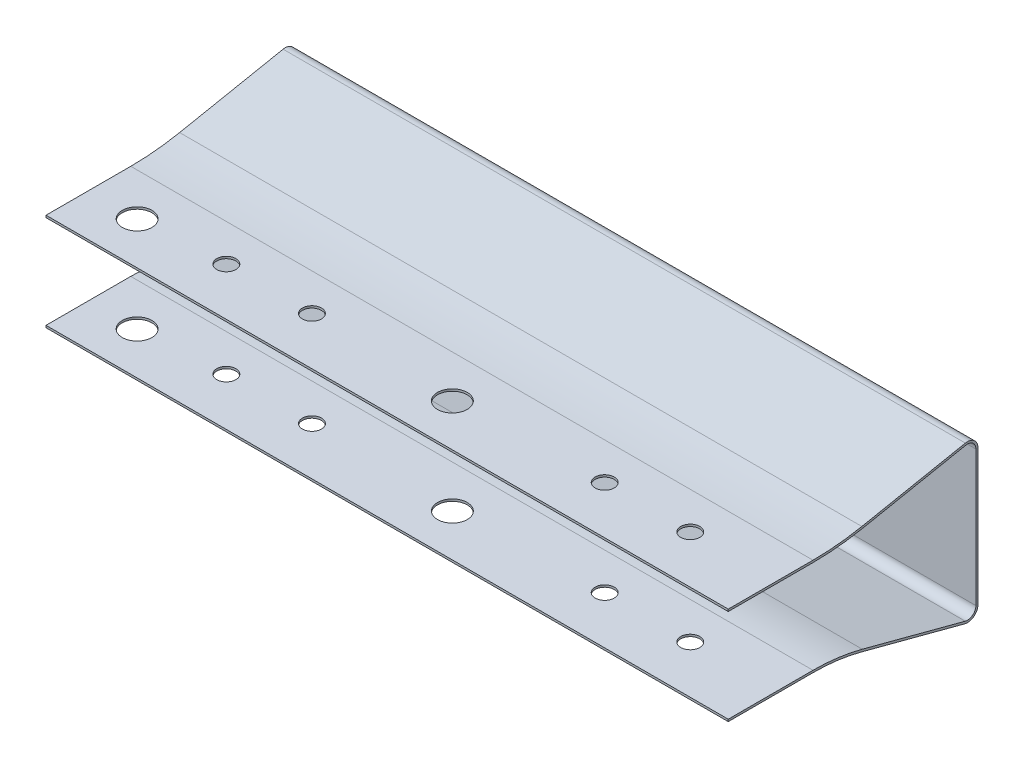
ISO-10303-21;
HEADER;
FILE_DESCRIPTION(('STEP AP214'),'2;1');
FILE_NAME('part.step','',(''),(''),'','','');
FILE_SCHEMA(('AUTOMOTIVE_DESIGN { 1 0 10303 214 1 1 1 1 }'));
ENDSEC;
DATA;
#1=APPLICATION_CONTEXT('core data for automotive mechanical design processes');
#2=APPLICATION_PROTOCOL_DEFINITION('international standard','automotive_design',2000,#1);
#3=PRODUCT_CONTEXT('',#1,'mechanical');
#4=PRODUCT('Part','Part','',(#3));
#5=PRODUCT_RELATED_PRODUCT_CATEGORY('part','',(#4));
#6=PRODUCT_DEFINITION_FORMATION('','',#4);
#7=PRODUCT_DEFINITION_CONTEXT('part definition',#1,'design');
#8=PRODUCT_DEFINITION('design','',#6,#7);
#9=PRODUCT_DEFINITION_SHAPE('','',#8);
#10=(LENGTH_UNIT() NAMED_UNIT(*) SI_UNIT(.MILLI.,.METRE.));
#11=(NAMED_UNIT(*) PLANE_ANGLE_UNIT() SI_UNIT($,.RADIAN.));
#12=(NAMED_UNIT(*) SI_UNIT($,.STERADIAN.) SOLID_ANGLE_UNIT());
#13=UNCERTAINTY_MEASURE_WITH_UNIT(LENGTH_MEASURE(1.E-05),#10,'distance_accuracy_value','');
#14=(GEOMETRIC_REPRESENTATION_CONTEXT(3) GLOBAL_UNCERTAINTY_ASSIGNED_CONTEXT((#13)) GLOBAL_UNIT_ASSIGNED_CONTEXT((#10,
#11,#12)) REPRESENTATION_CONTEXT('',''));
#15=CARTESIAN_POINT('',(0.,0.,0.));
#16=DIRECTION('',(0.,0.,1.));
#17=DIRECTION('',(1.,0.,0.));
#18=AXIS2_PLACEMENT_3D('',#15,#16,#17);
#19=CARTESIAN_POINT('',(40.25,8.,-23.22));
#20=DIRECTION('',(-1.,0.,0.));
#21=DIRECTION('',(0.,0.,-1.));
#22=AXIS2_PLACEMENT_3D('',#19,#20,#21);
#23=CYLINDRICAL_SURFACE('',#22,1.);
#24=CARTESIAN_POINT('',(-40.25,8.,-23.22));
#25=DIRECTION('',(1.,0.,0.));
#26=DIRECTION('',(0.,0.,1.));
#27=AXIS2_PLACEMENT_3D('',#24,#25,#26);
#28=CIRCLE('',#27,1.);
#29=CARTESIAN_POINT('',(-40.25,8.,-24.22));
#30=VERTEX_POINT('',#29);
#31=CARTESIAN_POINT('',(-40.25,8.98104394957776,-23.0262146316233));
#32=VERTEX_POINT('',#31);
#33=EDGE_CURVE('E206',#30,#32,#28,.T.);
#34=ORIENTED_EDGE('',*,*,#33,.F.);
#35=DIRECTION('',(-1.,0.,0.));
#36=VECTOR('',#35,1.);
#37=CARTESIAN_POINT('',(40.25,8.,-24.22));
#38=LINE('',#37,#36);
#39=CARTESIAN_POINT('',(40.25,8.,-24.22));
#40=VERTEX_POINT('',#39);
#41=EDGE_CURVE('E205',#40,#30,#38,.T.);
#42=ORIENTED_EDGE('',*,*,#41,.F.);
#43=CARTESIAN_POINT('',(40.25,8.,-23.22));
#44=DIRECTION('',(1.,0.,0.));
#45=DIRECTION('',(0.,0.,1.));
#46=AXIS2_PLACEMENT_3D('',#43,#44,#45);
#47=CIRCLE('',#46,1.);
#48=CARTESIAN_POINT('',(40.25,8.98104394957776,-23.0262146316233));
#49=VERTEX_POINT('',#48);
#50=EDGE_CURVE('E261',#40,#49,#47,.T.);
#51=ORIENTED_EDGE('',*,*,#50,.T.);
#52=DIRECTION('',(-1.,0.,0.));
#53=VECTOR('',#52,1.);
#54=CARTESIAN_POINT('',(40.25,8.98104394957776,-23.0262146316233));
#55=LINE('',#54,#53);
#56=EDGE_CURVE('E11',#49,#32,#55,.T.);
#57=ORIENTED_EDGE('',*,*,#56,.T.);
#58=EDGE_LOOP('',(#34,#42,#51,#57));
#59=FACE_BOUND('',#58,.T.);
#60=ADVANCED_FACE('F36',(#59),#23,.F.);
#61=CARTESIAN_POINT('',(40.25,6.56868151266737,-10.8135610513));
#62=DIRECTION('',(0.,0.981043949577754,0.193785368376667));
#63=DIRECTION('',(0.,0.193785368376667,-0.981043949577755));
#64=AXIS2_PLACEMENT_3D('',#61,#62,#63);
#65=PLANE('',#64);
#66=DIRECTION('',(0.,-0.193785368376667,0.981043949577754));
#67=VECTOR('',#66,1.);
#68=CARTESIAN_POINT('',(-40.25,6.56868151266737,-10.8135610513));
#69=LINE('',#68,#67);
#70=CARTESIAN_POINT('',(-40.25,6.56868151266737,-10.8135610513));
#71=VERTEX_POINT('',#70);
#72=EDGE_CURVE('E208',#32,#71,#69,.T.);
#73=ORIENTED_EDGE('',*,*,#72,.F.);
#74=ORIENTED_EDGE('',*,*,#56,.F.);
#75=DIRECTION('',(0.,-0.193785368376667,0.981043949577754));
#76=VECTOR('',#75,1.);
#77=CARTESIAN_POINT('',(40.25,6.56868151266737,-10.8135610513));
#78=LINE('',#77,#76);
#79=CARTESIAN_POINT('',(40.25,6.56868151266737,-10.8135610513));
#80=VERTEX_POINT('',#79);
#81=EDGE_CURVE('E128',#49,#80,#78,.T.);
#82=ORIENTED_EDGE('',*,*,#81,.T.);
#83=DIRECTION('',(-1.,0.,0.));
#84=VECTOR('',#83,1.);
#85=CARTESIAN_POINT('',(40.25,6.56868151266737,-10.8135610513));
#86=LINE('',#85,#84);
#87=EDGE_CURVE('E45',#80,#71,#86,.T.);
#88=ORIENTED_EDGE('',*,*,#87,.T.);
#89=EDGE_LOOP('',(#73,#74,#82,#88));
#90=FACE_BOUND('',#89,.T.);
#91=ADVANCED_FACE('F468',(#90),#65,.F.);
#92=CARTESIAN_POINT('',(40.25,36.,-5.));
#93=DIRECTION('',(-1.,0.,0.));
#94=DIRECTION('',(0.,0.,-1.));
#95=AXIS2_PLACEMENT_3D('',#92,#93,#94);
#96=CYLINDRICAL_SURFACE('',#95,30.);
#97=CARTESIAN_POINT('',(-40.25,36.,-5.));
#98=DIRECTION('',(-1.,0.,0.));
#99=DIRECTION('',(0.,0.,-1.));
#100=AXIS2_PLACEMENT_3D('',#97,#98,#99);
#101=CIRCLE('',#100,30.);
#102=CARTESIAN_POINT('',(-40.25,6.,-5.));
#103=VERTEX_POINT('',#102);
#104=EDGE_CURVE('E212',#71,#103,#101,.T.);
#105=ORIENTED_EDGE('',*,*,#104,.F.);
#106=ORIENTED_EDGE('',*,*,#87,.F.);
#107=CARTESIAN_POINT('',(40.25,36.,-5.));
#108=DIRECTION('',(-1.,0.,0.));
#109=DIRECTION('',(0.,0.,-1.));
#110=AXIS2_PLACEMENT_3D('',#107,#108,#109);
#111=CIRCLE('',#110,30.);
#112=CARTESIAN_POINT('',(40.25,6.,-5.));
#113=VERTEX_POINT('',#112);
#114=EDGE_CURVE('E382',#80,#113,#111,.T.);
#115=ORIENTED_EDGE('',*,*,#114,.T.);
#116=DIRECTION('',(-1.,0.,0.));
#117=VECTOR('',#116,1.);
#118=CARTESIAN_POINT('',(40.25,6.,-5.));
#119=LINE('',#118,#117);
#120=EDGE_CURVE('E304',#113,#103,#119,.T.);
#121=ORIENTED_EDGE('',*,*,#120,.T.);
#122=EDGE_LOOP('',(#105,#106,#115,#121));
#123=FACE_BOUND('',#122,.T.);
#124=ADVANCED_FACE('F466',(#123),#96,.T.);
#125=CARTESIAN_POINT('',(40.25,6.,-5.));
#126=DIRECTION('',(0.,1.,0.));
#127=DIRECTION('',(0.,0.,-1.));
#128=AXIS2_PLACEMENT_3D('',#125,#126,#127);
#129=PLANE('',#128);
#130=CARTESIAN_POINT('',(30.12,6.,-0.649999999999999));
#131=DIRECTION('',(0.,-1.,0.));
#132=DIRECTION('',(0.,0.,-1.));
#133=AXIS2_PLACEMENT_3D('',#130,#131,#132);
#134=CIRCLE('',#133,1.125);
#135=CARTESIAN_POINT('',(30.12,6.,-1.775));
#136=VERTEX_POINT('',#135);
#137=EDGE_CURVE('E331',#136,#136,#134,.T.);
#138=ORIENTED_EDGE('',*,*,#137,.F.);
#139=EDGE_LOOP('',(#138));
#140=FACE_BOUND('',#139,.T.);
#141=CARTESIAN_POINT('',(20.02,6.,-0.649999999999998));
#142=DIRECTION('',(0.,-1.,0.));
#143=DIRECTION('',(0.,0.,-1.));
#144=AXIS2_PLACEMENT_3D('',#141,#142,#143);
#145=CIRCLE('',#144,1.125);
#146=CARTESIAN_POINT('',(20.02,6.,-1.775));
#147=VERTEX_POINT('',#146);
#148=EDGE_CURVE('E327',#147,#147,#145,.T.);
#149=ORIENTED_EDGE('',*,*,#148,.F.);
#150=EDGE_LOOP('',(#149));
#151=FACE_BOUND('',#150,.T.);
#152=CARTESIAN_POINT('',(2.69999999999999,6.,0.));
#153=DIRECTION('',(0.,-1.,0.));
#154=DIRECTION('',(0.,0.,-1.));
#155=AXIS2_PLACEMENT_3D('',#152,#153,#154);
#156=CIRCLE('',#155,1.75);
#157=CARTESIAN_POINT('',(2.69999999999999,6.,-1.75));
#158=VERTEX_POINT('',#157);
#159=EDGE_CURVE('E323',#158,#158,#156,.T.);
#160=ORIENTED_EDGE('',*,*,#159,.F.);
#161=EDGE_LOOP('',(#160));
#162=FACE_BOUND('',#161,.T.);
#163=CARTESIAN_POINT('',(-14.52,6.,-0.649999999999999));
#164=DIRECTION('',(0.,-1.,0.));
#165=DIRECTION('',(0.,0.,-1.));
#166=AXIS2_PLACEMENT_3D('',#163,#164,#165);
#167=CIRCLE('',#166,1.125);
#168=CARTESIAN_POINT('',(-14.52,6.,-1.775));
#169=VERTEX_POINT('',#168);
#170=EDGE_CURVE('E318',#169,#169,#167,.T.);
#171=ORIENTED_EDGE('',*,*,#170,.F.);
#172=EDGE_LOOP('',(#171));
#173=FACE_BOUND('',#172,.T.);
#174=CARTESIAN_POINT('',(-24.62,6.,-0.649999999999998));
#175=DIRECTION('',(0.,-1.,0.));
#176=DIRECTION('',(0.,0.,-1.));
#177=AXIS2_PLACEMENT_3D('',#174,#175,#176);
#178=CIRCLE('',#177,1.125);
#179=CARTESIAN_POINT('',(-24.62,6.,-1.775));
#180=VERTEX_POINT('',#179);
#181=EDGE_CURVE('E313',#180,#180,#178,.T.);
#182=ORIENTED_EDGE('',*,*,#181,.F.);
#183=EDGE_LOOP('',(#182));
#184=FACE_BOUND('',#183,.T.);
#185=CARTESIAN_POINT('',(-34.5,6.,0.));
#186=DIRECTION('',(0.,-1.,0.));
#187=DIRECTION('',(0.,0.,-1.));
#188=AXIS2_PLACEMENT_3D('',#185,#186,#187);
#189=CIRCLE('',#188,1.75);
#190=CARTESIAN_POINT('',(-34.5,6.,-1.75));
#191=VERTEX_POINT('',#190);
#192=EDGE_CURVE('E209',#191,#191,#189,.T.);
#193=ORIENTED_EDGE('',*,*,#192,.F.);
#194=EDGE_LOOP('',(#193));
#195=FACE_BOUND('',#194,.T.);
#196=DIRECTION('',(0.,0.,1.));
#197=VECTOR('',#196,1.);
#198=CARTESIAN_POINT('',(-40.25,6.,-5.));
#199=LINE('',#198,#197);
#200=CARTESIAN_POINT('',(-40.25,6.,5.));
#201=VERTEX_POINT('',#200);
#202=EDGE_CURVE('E215',#103,#201,#199,.T.);
#203=ORIENTED_EDGE('',*,*,#202,.F.);
#204=ORIENTED_EDGE('',*,*,#120,.F.);
#205=DIRECTION('',(0.,0.,1.));
#206=VECTOR('',#205,1.);
#207=CARTESIAN_POINT('',(40.25,6.,-5.));
#208=LINE('',#207,#206);
#209=CARTESIAN_POINT('',(40.25,6.,5.));
#210=VERTEX_POINT('',#209);
#211=EDGE_CURVE('E385',#113,#210,#208,.T.);
#212=ORIENTED_EDGE('',*,*,#211,.T.);
#213=DIRECTION('',(-1.,0.,0.));
#214=VECTOR('',#213,1.);
#215=CARTESIAN_POINT('',(40.25,6.,5.));
#216=LINE('',#215,#214);
#217=EDGE_CURVE('E301',#210,#201,#216,.T.);
#218=ORIENTED_EDGE('',*,*,#217,.T.);
#219=EDGE_LOOP('',(#203,#204,#212,#218));
#220=FACE_BOUND('',#219,.T.);
#221=ADVANCED_FACE('F464',(#140,#151,#162,#173,#184,#195,#220),#129,.F.);
#222=CARTESIAN_POINT('',(40.25,6.25,5.));
#223=DIRECTION('',(0.,0.,-1.));
#224=DIRECTION('',(1.,0.,0.));
#225=AXIS2_PLACEMENT_3D('',#222,#223,#224);
#226=PLANE('',#225);
#227=DIRECTION('',(0.,1.,0.));
#228=VECTOR('',#227,1.);
#229=CARTESIAN_POINT('',(-40.25,6.25,5.));
#230=LINE('',#229,#228);
#231=CARTESIAN_POINT('',(-40.25,6.25,5.));
#232=VERTEX_POINT('',#231);
#233=EDGE_CURVE('E218',#201,#232,#230,.T.);
#234=ORIENTED_EDGE('',*,*,#233,.F.);
#235=ORIENTED_EDGE('',*,*,#217,.F.);
#236=DIRECTION('',(0.,1.,0.));
#237=VECTOR('',#236,1.);
#238=CARTESIAN_POINT('',(40.25,6.25,5.));
#239=LINE('',#238,#237);
#240=CARTESIAN_POINT('',(40.25,6.25,5.));
#241=VERTEX_POINT('',#240);
#242=EDGE_CURVE('E388',#210,#241,#239,.T.);
#243=ORIENTED_EDGE('',*,*,#242,.T.);
#244=DIRECTION('',(-1.,0.,0.));
#245=VECTOR('',#244,1.);
#246=CARTESIAN_POINT('',(40.25,6.25,5.));
#247=LINE('',#246,#245);
#248=EDGE_CURVE('E298',#241,#232,#247,.T.);
#249=ORIENTED_EDGE('',*,*,#248,.T.);
#250=EDGE_LOOP('',(#234,#235,#243,#249));
#251=FACE_BOUND('',#250,.T.);
#252=ADVANCED_FACE('F460',(#251),#226,.F.);
#253=CARTESIAN_POINT('',(40.25,6.25,-5.));
#254=DIRECTION('',(0.,-1.,0.));
#255=DIRECTION('',(0.,0.,1.));
#256=AXIS2_PLACEMENT_3D('',#253,#254,#255);
#257=PLANE('',#256);
#258=CARTESIAN_POINT('',(30.12,6.25,-0.649999999999999));
#259=DIRECTION('',(0.,1.,0.));
#260=DIRECTION('',(0.,0.,1.));
#261=AXIS2_PLACEMENT_3D('',#258,#259,#260);
#262=CIRCLE('',#261,1.125);
#263=CARTESIAN_POINT('',(30.12,6.25,0.475000000000003));
#264=VERTEX_POINT('',#263);
#265=EDGE_CURVE('E338',#264,#264,#262,.T.);
#266=ORIENTED_EDGE('',*,*,#265,.F.);
#267=EDGE_LOOP('',(#266));
#268=FACE_BOUND('',#267,.T.);
#269=CARTESIAN_POINT('',(20.02,6.25,-0.649999999999998));
#270=DIRECTION('',(0.,1.,0.));
#271=DIRECTION('',(0.,0.,1.));
#272=AXIS2_PLACEMENT_3D('',#269,#270,#271);
#273=CIRCLE('',#272,1.125);
#274=CARTESIAN_POINT('',(20.02,6.25,0.475000000000003));
#275=VERTEX_POINT('',#274);
#276=EDGE_CURVE('E335',#275,#275,#273,.T.);
#277=ORIENTED_EDGE('',*,*,#276,.F.);
#278=EDGE_LOOP('',(#277));
#279=FACE_BOUND('',#278,.T.);
#280=CARTESIAN_POINT('',(2.69999999999999,6.25,0.));
#281=DIRECTION('',(0.,1.,0.));
#282=DIRECTION('',(0.,0.,1.));
#283=AXIS2_PLACEMENT_3D('',#280,#281,#282);
#284=CIRCLE('',#283,1.75);
#285=CARTESIAN_POINT('',(2.69999999999999,6.25,1.75));
#286=VERTEX_POINT('',#285);
#287=EDGE_CURVE('E353',#286,#286,#284,.T.);
#288=ORIENTED_EDGE('',*,*,#287,.F.);
#289=EDGE_LOOP('',(#288));
#290=FACE_BOUND('',#289,.T.);
#291=CARTESIAN_POINT('',(-14.52,6.25,-0.649999999999999));
#292=DIRECTION('',(0.,1.,0.));
#293=DIRECTION('',(0.,0.,1.));
#294=AXIS2_PLACEMENT_3D('',#291,#292,#293);
#295=CIRCLE('',#294,1.125);
#296=CARTESIAN_POINT('',(-14.52,6.25,0.475000000000003));
#297=VERTEX_POINT('',#296);
#298=EDGE_CURVE('E360',#297,#297,#295,.T.);
#299=ORIENTED_EDGE('',*,*,#298,.F.);
#300=EDGE_LOOP('',(#299));
#301=FACE_BOUND('',#300,.T.);
#302=CARTESIAN_POINT('',(-24.62,6.25,-0.649999999999998));
#303=DIRECTION('',(0.,1.,0.));
#304=DIRECTION('',(0.,0.,1.));
#305=AXIS2_PLACEMENT_3D('',#302,#303,#304);
#306=CIRCLE('',#305,1.125);
#307=CARTESIAN_POINT('',(-24.62,6.25,0.475000000000003));
#308=VERTEX_POINT('',#307);
#309=EDGE_CURVE('E367',#308,#308,#306,.T.);
#310=ORIENTED_EDGE('',*,*,#309,.F.);
#311=EDGE_LOOP('',(#310));
#312=FACE_BOUND('',#311,.T.);
#313=CARTESIAN_POINT('',(-34.5,6.25,0.));
#314=DIRECTION('',(0.,1.,0.));
#315=DIRECTION('',(0.,0.,1.));
#316=AXIS2_PLACEMENT_3D('',#313,#314,#315);
#317=CIRCLE('',#316,1.75);
#318=CARTESIAN_POINT('',(-34.5,6.25,1.75));
#319=VERTEX_POINT('',#318);
#320=EDGE_CURVE('E374',#319,#319,#317,.T.);
#321=ORIENTED_EDGE('',*,*,#320,.F.);
#322=EDGE_LOOP('',(#321));
#323=FACE_BOUND('',#322,.T.);
#324=DIRECTION('',(0.,0.,-1.));
#325=VECTOR('',#324,1.);
#326=CARTESIAN_POINT('',(-40.25,6.25,-5.));
#327=LINE('',#326,#325);
#328=CARTESIAN_POINT('',(-40.25,6.25,-4.99999999999999));
#329=VERTEX_POINT('',#328);
#330=EDGE_CURVE('E221',#232,#329,#327,.T.);
#331=ORIENTED_EDGE('',*,*,#330,.F.);
#332=ORIENTED_EDGE('',*,*,#248,.F.);
#333=DIRECTION('',(0.,0.,-1.));
#334=VECTOR('',#333,1.);
#335=CARTESIAN_POINT('',(40.25,6.25,-5.));
#336=LINE('',#335,#334);
#337=CARTESIAN_POINT('',(40.25,6.25,-4.99999999999999));
#338=VERTEX_POINT('',#337);
#339=EDGE_CURVE('E391',#241,#338,#336,.T.);
#340=ORIENTED_EDGE('',*,*,#339,.T.);
#341=DIRECTION('',(-1.,0.,0.));
#342=VECTOR('',#341,1.);
#343=CARTESIAN_POINT('',(40.25,6.25,-4.99999999999999));
#344=LINE('',#343,#342);
#345=EDGE_CURVE('E295',#338,#329,#344,.T.);
#346=ORIENTED_EDGE('',*,*,#345,.T.);
#347=EDGE_LOOP('',(#331,#332,#340,#346));
#348=FACE_BOUND('',#347,.T.);
#349=ADVANCED_FACE('F457',(#268,#279,#290,#301,#312,#323,#348),#257,.F.);
#350=CARTESIAN_POINT('',(40.25,36.,-5.));
#351=DIRECTION('',(-1.,0.,0.));
#352=DIRECTION('',(0.,0.,-1.));
#353=AXIS2_PLACEMENT_3D('',#350,#351,#352);
#354=CYLINDRICAL_SURFACE('',#353,29.75);
#355=CARTESIAN_POINT('',(-40.25,36.,-5.));
#356=DIRECTION('',(1.,0.,0.));
#357=DIRECTION('',(0.,0.,-1.));
#358=AXIS2_PLACEMENT_3D('',#355,#356,#357);
#359=CIRCLE('',#358,29.75);
#360=CARTESIAN_POINT('',(-40.25,6.81394250006181,-10.7651147092058));
#361=VERTEX_POINT('',#360);
#362=EDGE_CURVE('E224',#329,#361,#359,.T.);
#363=ORIENTED_EDGE('',*,*,#362,.F.);
#364=ORIENTED_EDGE('',*,*,#345,.F.);
#365=CARTESIAN_POINT('',(40.25,36.,-5.));
#366=DIRECTION('',(1.,0.,0.));
#367=DIRECTION('',(0.,0.,-1.));
#368=AXIS2_PLACEMENT_3D('',#365,#366,#367);
#369=CIRCLE('',#368,29.75);
#370=CARTESIAN_POINT('',(40.25,6.81394250006181,-10.7651147092058));
#371=VERTEX_POINT('',#370);
#372=EDGE_CURVE('E394',#338,#371,#369,.T.);
#373=ORIENTED_EDGE('',*,*,#372,.T.);
#374=DIRECTION('',(-1.,0.,0.));
#375=VECTOR('',#374,1.);
#376=CARTESIAN_POINT('',(40.25,6.81394250006181,-10.7651147092058));
#377=LINE('',#376,#375);
#378=EDGE_CURVE('E292',#371,#361,#377,.T.);
#379=ORIENTED_EDGE('',*,*,#378,.T.);
#380=EDGE_LOOP('',(#363,#364,#373,#379));
#381=FACE_BOUND('',#380,.T.);
#382=ADVANCED_FACE('F455',(#381),#354,.F.);
#383=CARTESIAN_POINT('',(40.25,6.81394250006181,-10.7651147092058));
#384=DIRECTION('',(0.,-0.981043949577754,-0.193785368376667));
#385=DIRECTION('',(0.,-0.193785368376668,0.981043949577754));
#386=AXIS2_PLACEMENT_3D('',#383,#384,#385);
#387=PLANE('',#386);
#388=DIRECTION('',(0.,0.193785368376668,-0.981043949577754));
#389=VECTOR('',#388,1.);
#390=CARTESIAN_POINT('',(-40.25,6.81394250006181,-10.7651147092058));
#391=LINE('',#390,#389);
#392=CARTESIAN_POINT('',(-40.25,9.22630493697219,-22.9777682895292));
#393=VERTEX_POINT('',#392);
#394=EDGE_CURVE('E227',#361,#393,#391,.T.);
#395=ORIENTED_EDGE('',*,*,#394,.F.);
#396=ORIENTED_EDGE('',*,*,#378,.F.);
#397=DIRECTION('',(0.,0.193785368376668,-0.981043949577754));
#398=VECTOR('',#397,1.);
#399=CARTESIAN_POINT('',(40.25,6.81394250006181,-10.7651147092058));
#400=LINE('',#399,#398);
#401=CARTESIAN_POINT('',(40.25,9.22630493697219,-22.9777682895292));
#402=VERTEX_POINT('',#401);
#403=EDGE_CURVE('E397',#371,#402,#400,.T.);
#404=ORIENTED_EDGE('',*,*,#403,.T.);
#405=DIRECTION('',(-1.,0.,0.));
#406=VECTOR('',#405,1.);
#407=CARTESIAN_POINT('',(40.25,9.22630493697219,-22.9777682895292));
#408=LINE('',#407,#406);
#409=EDGE_CURVE('E289',#402,#393,#408,.T.);
#410=ORIENTED_EDGE('',*,*,#409,.T.);
#411=EDGE_LOOP('',(#395,#396,#404,#410));
#412=FACE_BOUND('',#411,.T.);
#413=ADVANCED_FACE('F451',(#412),#387,.F.);
#414=CARTESIAN_POINT('',(40.25,8.,-23.22));
#415=DIRECTION('',(-1.,0.,0.));
#416=DIRECTION('',(0.,0.,-1.));
#417=AXIS2_PLACEMENT_3D('',#414,#415,#416);
#418=CYLINDRICAL_SURFACE('',#417,1.25);
#419=CARTESIAN_POINT('',(-40.25,8.,-23.22));
#420=DIRECTION('',(-1.,0.,0.));
#421=DIRECTION('',(0.,0.,1.));
#422=AXIS2_PLACEMENT_3D('',#419,#420,#421);
#423=CIRCLE('',#422,1.25);
#424=CARTESIAN_POINT('',(-40.25,8.,-24.47));
#425=VERTEX_POINT('',#424);
#426=EDGE_CURVE('E230',#393,#425,#423,.T.);
#427=ORIENTED_EDGE('',*,*,#426,.F.);
#428=ORIENTED_EDGE('',*,*,#409,.F.);
#429=CARTESIAN_POINT('',(40.25,8.,-23.22));
#430=DIRECTION('',(-1.,0.,0.));
#431=DIRECTION('',(0.,0.,1.));
#432=AXIS2_PLACEMENT_3D('',#429,#430,#431);
#433=CIRCLE('',#432,1.25);
#434=CARTESIAN_POINT('',(40.25,8.,-24.47));
#435=VERTEX_POINT('',#434);
#436=EDGE_CURVE('E400',#402,#435,#433,.T.);
#437=ORIENTED_EDGE('',*,*,#436,.T.);
#438=DIRECTION('',(-1.,0.,0.));
#439=VECTOR('',#438,1.);
#440=CARTESIAN_POINT('',(40.25,8.,-24.47));
#441=LINE('',#440,#439);
#442=EDGE_CURVE('E286',#435,#425,#441,.T.);
#443=ORIENTED_EDGE('',*,*,#442,.T.);
#444=EDGE_LOOP('',(#427,#428,#437,#443));
#445=FACE_BOUND('',#444,.T.);
#446=ADVANCED_FACE('F448',(#445),#418,.T.);
#447=CARTESIAN_POINT('',(40.25,8.,-24.47));
#448=DIRECTION('',(0.,0.,1.));
#449=DIRECTION('',(-1.,0.,0.));
#450=AXIS2_PLACEMENT_3D('',#447,#448,#449);
#451=PLANE('',#450);
#452=DIRECTION('',(0.,-1.,0.));
#453=VECTOR('',#452,1.);
#454=CARTESIAN_POINT('',(-40.25,8.,-24.47));
#455=LINE('',#454,#453);
#456=CARTESIAN_POINT('',(-40.25,-8.,-24.47));
#457=VERTEX_POINT('',#456);
#458=EDGE_CURVE('E233',#425,#457,#455,.T.);
#459=ORIENTED_EDGE('',*,*,#458,.F.);
#460=ORIENTED_EDGE('',*,*,#442,.F.);
#461=DIRECTION('',(0.,-1.,0.));
#462=VECTOR('',#461,1.);
#463=CARTESIAN_POINT('',(40.25,8.,-24.47));
#464=LINE('',#463,#462);
#465=CARTESIAN_POINT('',(40.25,-8.,-24.47));
#466=VERTEX_POINT('',#465);
#467=EDGE_CURVE('E403',#435,#466,#464,.T.);
#468=ORIENTED_EDGE('',*,*,#467,.T.);
#469=DIRECTION('',(-1.,0.,0.));
#470=VECTOR('',#469,1.);
#471=CARTESIAN_POINT('',(40.25,-8.,-24.47));
#472=LINE('',#471,#470);
#473=EDGE_CURVE('E283',#466,#457,#472,.T.);
#474=ORIENTED_EDGE('',*,*,#473,.T.);
#475=EDGE_LOOP('',(#459,#460,#468,#474));
#476=FACE_BOUND('',#475,.T.);
#477=ADVANCED_FACE('F446',(#476),#451,.F.);
#478=CARTESIAN_POINT('',(40.25,-8.,-23.22));
#479=DIRECTION('',(-1.,0.,0.));
#480=DIRECTION('',(0.,0.,-1.));
#481=AXIS2_PLACEMENT_3D('',#478,#479,#480);
#482=CYLINDRICAL_SURFACE('',#481,1.25);
#483=CARTESIAN_POINT('',(-40.25,-8.,-23.22));
#484=DIRECTION('',(-1.,0.,0.));
#485=DIRECTION('',(0.,0.,1.));
#486=AXIS2_PLACEMENT_3D('',#483,#484,#485);
#487=CIRCLE('',#486,1.25);
#488=CARTESIAN_POINT('',(-40.25,-9.20850235944556,-22.9005910971583));
#489=VERTEX_POINT('',#488);
#490=EDGE_CURVE('E236',#457,#489,#487,.T.);
#491=ORIENTED_EDGE('',*,*,#490,.F.);
#492=ORIENTED_EDGE('',*,*,#473,.F.);
#493=CARTESIAN_POINT('',(40.25,-8.,-23.22));
#494=DIRECTION('',(-1.,0.,0.));
#495=DIRECTION('',(0.,0.,1.));
#496=AXIS2_PLACEMENT_3D('',#493,#494,#495);
#497=CIRCLE('',#496,1.25);
#498=CARTESIAN_POINT('',(40.25,-9.20850235944556,-22.9005910971583));
#499=VERTEX_POINT('',#498);
#500=EDGE_CURVE('E406',#466,#499,#497,.T.);
#501=ORIENTED_EDGE('',*,*,#500,.T.);
#502=DIRECTION('',(-1.,0.,0.));
#503=VECTOR('',#502,1.);
#504=CARTESIAN_POINT('',(40.25,-9.20850235944556,-22.9005910971583));
#505=LINE('',#504,#503);
#506=EDGE_CURVE('E280',#499,#489,#505,.T.);
#507=ORIENTED_EDGE('',*,*,#506,.T.);
#508=EDGE_LOOP('',(#491,#492,#501,#507));
#509=FACE_BOUND('',#508,.T.);
#510=ADVANCED_FACE('F442',(#509),#482,.T.);
#511=CARTESIAN_POINT('',(40.25,-5.99699897703984,-10.7496792707317));
#512=DIRECTION('',(0.,0.966801887556448,-0.25552712227333));
#513=DIRECTION('',(0.,-0.25552712227333,-0.966801887556448));
#514=AXIS2_PLACEMENT_3D('',#511,#512,#513);
#515=PLANE('',#514);
#516=DIRECTION('',(0.,0.255527122273329,0.966801887556448));
#517=VECTOR('',#516,1.);
#518=CARTESIAN_POINT('',(-40.25,-5.99699897703984,-10.7496792707317));
#519=LINE('',#518,#517);
#520=CARTESIAN_POINT('',(-40.25,-5.99699897703983,-10.7496792707317));
#521=VERTEX_POINT('',#520);
#522=EDGE_CURVE('E239',#489,#521,#519,.T.);
#523=ORIENTED_EDGE('',*,*,#522,.F.);
#524=ORIENTED_EDGE('',*,*,#506,.F.);
#525=DIRECTION('',(0.,0.255527122273329,0.966801887556448));
#526=VECTOR('',#525,1.);
#527=CARTESIAN_POINT('',(40.25,-5.99699897703984,-10.7496792707317));
#528=LINE('',#527,#526);
#529=CARTESIAN_POINT('',(40.25,-5.99699897703983,-10.7496792707317));
#530=VERTEX_POINT('',#529);
#531=EDGE_CURVE('E409',#499,#530,#528,.T.);
#532=ORIENTED_EDGE('',*,*,#531,.T.);
#533=DIRECTION('',(-1.,0.,0.));
#534=VECTOR('',#533,1.);
#535=CARTESIAN_POINT('',(40.25,-5.99699897703983,-10.7496792707317));
#536=LINE('',#535,#534);
#537=EDGE_CURVE('E277',#530,#521,#536,.T.);
#538=ORIENTED_EDGE('',*,*,#537,.T.);
#539=EDGE_LOOP('',(#523,#524,#532,#538));
#540=FACE_BOUND('',#539,.T.);
#541=ADVANCED_FACE('F439',(#540),#515,.F.);
#542=CARTESIAN_POINT('',(40.25,-27.7512484764001,-5.));
#543=DIRECTION('',(-1.,0.,0.));
#544=DIRECTION('',(0.,0.,-1.));
#545=AXIS2_PLACEMENT_3D('',#542,#543,#544);
#546=CYLINDRICAL_SURFACE('',#545,22.5012484764001);
#547=CARTESIAN_POINT('',(-40.25,-27.7512484764001,-5.));
#548=DIRECTION('',(1.,0.,0.));
#549=DIRECTION('',(0.,0.,1.));
#550=AXIS2_PLACEMENT_3D('',#547,#548,#549);
#551=CIRCLE('',#550,22.5012484764001);
#552=CARTESIAN_POINT('',(-40.25,-5.25,-5.));
#553=VERTEX_POINT('',#552);
#554=EDGE_CURVE('E242',#521,#553,#551,.T.);
#555=ORIENTED_EDGE('',*,*,#554,.F.);
#556=ORIENTED_EDGE('',*,*,#537,.F.);
#557=CARTESIAN_POINT('',(40.25,-27.7512484764001,-5.));
#558=DIRECTION('',(1.,0.,0.));
#559=DIRECTION('',(0.,0.,1.));
#560=AXIS2_PLACEMENT_3D('',#557,#558,#559);
#561=CIRCLE('',#560,22.5012484764001);
#562=CARTESIAN_POINT('',(40.25,-5.25,-5.));
#563=VERTEX_POINT('',#562);
#564=EDGE_CURVE('E412',#530,#563,#561,.T.);
#565=ORIENTED_EDGE('',*,*,#564,.T.);
#566=DIRECTION('',(-1.,0.,0.));
#567=VECTOR('',#566,1.);
#568=CARTESIAN_POINT('',(40.25,-5.25,-5.));
#569=LINE('',#568,#567);
#570=EDGE_CURVE('E274',#563,#553,#569,.T.);
#571=ORIENTED_EDGE('',*,*,#570,.T.);
#572=EDGE_LOOP('',(#555,#556,#565,#571));
#573=FACE_BOUND('',#572,.T.);
#574=ADVANCED_FACE('F437',(#573),#546,.F.);
#575=CARTESIAN_POINT('',(40.25,-5.25,-5.));
#576=DIRECTION('',(0.,1.,0.));
#577=DIRECTION('',(0.,0.,-1.));
#578=AXIS2_PLACEMENT_3D('',#575,#576,#577);
#579=PLANE('',#578);
#580=CARTESIAN_POINT('',(30.12,-5.25,-0.649999999999999));
#581=DIRECTION('',(0.,-1.,0.));
#582=DIRECTION('',(0.,0.,-1.));
#583=AXIS2_PLACEMENT_3D('',#580,#581,#582);
#584=CIRCLE('',#583,1.125);
#585=CARTESIAN_POINT('',(30.12,-5.25,-1.775));
#586=VERTEX_POINT('',#585);
#587=EDGE_CURVE('E343',#586,#586,#584,.T.);
#588=ORIENTED_EDGE('',*,*,#587,.F.);
#589=EDGE_LOOP('',(#588));
#590=FACE_BOUND('',#589,.T.);
#591=CARTESIAN_POINT('',(20.02,-5.25,-0.649999999999998));
#592=DIRECTION('',(0.,-1.,0.));
#593=DIRECTION('',(0.,0.,-1.));
#594=AXIS2_PLACEMENT_3D('',#591,#592,#593);
#595=CIRCLE('',#594,1.125);
#596=CARTESIAN_POINT('',(20.02,-5.25,-1.775));
#597=VERTEX_POINT('',#596);
#598=EDGE_CURVE('E330',#597,#597,#595,.T.);
#599=ORIENTED_EDGE('',*,*,#598,.F.);
#600=EDGE_LOOP('',(#599));
#601=FACE_BOUND('',#600,.T.);
#602=CARTESIAN_POINT('',(2.69999999999999,-5.25,0.));
#603=DIRECTION('',(0.,-1.,0.));
#604=DIRECTION('',(0.,0.,-1.));
#605=AXIS2_PLACEMENT_3D('',#602,#603,#604);
#606=CIRCLE('',#605,1.75);
#607=CARTESIAN_POINT('',(2.69999999999999,-5.25,-1.75));
#608=VERTEX_POINT('',#607);
#609=EDGE_CURVE('E326',#608,#608,#606,.T.);
#610=ORIENTED_EDGE('',*,*,#609,.F.);
#611=EDGE_LOOP('',(#610));
#612=FACE_BOUND('',#611,.T.);
#613=CARTESIAN_POINT('',(-14.52,-5.25,-0.649999999999999));
#614=DIRECTION('',(0.,-1.,0.));
#615=DIRECTION('',(0.,0.,-1.));
#616=AXIS2_PLACEMENT_3D('',#613,#614,#615);
#617=CIRCLE('',#616,1.125);
#618=CARTESIAN_POINT('',(-14.52,-5.25,-1.775));
#619=VERTEX_POINT('',#618);
#620=EDGE_CURVE('E322',#619,#619,#617,.T.);
#621=ORIENTED_EDGE('',*,*,#620,.F.);
#622=EDGE_LOOP('',(#621));
#623=FACE_BOUND('',#622,.T.);
#624=CARTESIAN_POINT('',(-24.62,-5.25,-0.649999999999998));
#625=DIRECTION('',(0.,-1.,0.));
#626=DIRECTION('',(0.,0.,-1.));
#627=AXIS2_PLACEMENT_3D('',#624,#625,#626);
#628=CIRCLE('',#627,1.125);
#629=CARTESIAN_POINT('',(-24.62,-5.25,-1.775));
#630=VERTEX_POINT('',#629);
#631=EDGE_CURVE('E317',#630,#630,#628,.T.);
#632=ORIENTED_EDGE('',*,*,#631,.F.);
#633=EDGE_LOOP('',(#632));
#634=FACE_BOUND('',#633,.T.);
#635=CARTESIAN_POINT('',(-34.5,-5.25,0.));
#636=DIRECTION('',(0.,-1.,0.));
#637=DIRECTION('',(0.,0.,-1.));
#638=AXIS2_PLACEMENT_3D('',#635,#636,#637);
#639=CIRCLE('',#638,1.75);
#640=CARTESIAN_POINT('',(-34.5,-5.25,-1.75));
#641=VERTEX_POINT('',#640);
#642=EDGE_CURVE('E312',#641,#641,#639,.T.);
#643=ORIENTED_EDGE('',*,*,#642,.F.);
#644=EDGE_LOOP('',(#643));
#645=FACE_BOUND('',#644,.T.);
#646=DIRECTION('',(0.,0.,1.));
#647=VECTOR('',#646,1.);
#648=CARTESIAN_POINT('',(-40.25,-5.25,-5.));
#649=LINE('',#648,#647);
#650=CARTESIAN_POINT('',(-40.25,-5.25,5.));
#651=VERTEX_POINT('',#650);
#652=EDGE_CURVE('E245',#553,#651,#649,.T.);
#653=ORIENTED_EDGE('',*,*,#652,.F.);
#654=ORIENTED_EDGE('',*,*,#570,.F.);
#655=DIRECTION('',(0.,0.,1.));
#656=VECTOR('',#655,1.);
#657=CARTESIAN_POINT('',(40.25,-5.25,-5.));
#658=LINE('',#657,#656);
#659=CARTESIAN_POINT('',(40.25,-5.25,5.));
#660=VERTEX_POINT('',#659);
#661=EDGE_CURVE('E415',#563,#660,#658,.T.);
#662=ORIENTED_EDGE('',*,*,#661,.T.);
#663=DIRECTION('',(-1.,0.,0.));
#664=VECTOR('',#663,1.);
#665=CARTESIAN_POINT('',(40.25,-5.25,5.));
#666=LINE('',#665,#664);
#667=EDGE_CURVE('E271',#660,#651,#666,.T.);
#668=ORIENTED_EDGE('',*,*,#667,.T.);
#669=EDGE_LOOP('',(#653,#654,#662,#668));
#670=FACE_BOUND('',#669,.T.);
#671=ADVANCED_FACE('F433',(#590,#601,#612,#623,#634,#645,#670),#579,.F.);
#672=CARTESIAN_POINT('',(40.25,-5.,5.));
#673=DIRECTION('',(0.,0.,-1.));
#674=DIRECTION('',(1.,0.,0.));
#675=AXIS2_PLACEMENT_3D('',#672,#673,#674);
#676=PLANE('',#675);
#677=DIRECTION('',(0.,1.,0.));
#678=VECTOR('',#677,1.);
#679=CARTESIAN_POINT('',(-40.25,-5.,5.));
#680=LINE('',#679,#678);
#681=CARTESIAN_POINT('',(-40.25,-5.,5.));
#682=VERTEX_POINT('',#681);
#683=EDGE_CURVE('E248',#651,#682,#680,.T.);
#684=ORIENTED_EDGE('',*,*,#683,.F.);
#685=ORIENTED_EDGE('',*,*,#667,.F.);
#686=DIRECTION('',(0.,1.,0.));
#687=VECTOR('',#686,1.);
#688=CARTESIAN_POINT('',(40.25,-5.,5.));
#689=LINE('',#688,#687);
#690=CARTESIAN_POINT('',(40.25,-5.,5.));
#691=VERTEX_POINT('',#690);
#692=EDGE_CURVE('E418',#660,#691,#689,.T.);
#693=ORIENTED_EDGE('',*,*,#692,.T.);
#694=DIRECTION('',(-1.,0.,0.));
#695=VECTOR('',#694,1.);
#696=CARTESIAN_POINT('',(40.25,-5.,5.));
#697=LINE('',#696,#695);
#698=EDGE_CURVE('E268',#691,#682,#697,.T.);
#699=ORIENTED_EDGE('',*,*,#698,.T.);
#700=EDGE_LOOP('',(#684,#685,#693,#699));
#701=FACE_BOUND('',#700,.T.);
#702=ADVANCED_FACE('F430',(#701),#676,.F.);
#703=CARTESIAN_POINT('',(40.25,-5.,-5.));
#704=DIRECTION('',(0.,-1.,0.));
#705=DIRECTION('',(0.,0.,1.));
#706=AXIS2_PLACEMENT_3D('',#703,#704,#705);
#707=PLANE('',#706);
#708=CARTESIAN_POINT('',(30.12,-5.,-0.649999999999999));
#709=DIRECTION('',(0.,1.,0.));
#710=DIRECTION('',(0.,0.,1.));
#711=AXIS2_PLACEMENT_3D('',#708,#709,#710);
#712=CIRCLE('',#711,1.125);
#713=CARTESIAN_POINT('',(30.12,-5.,0.475000000000003));
#714=VERTEX_POINT('',#713);
#715=EDGE_CURVE('E39',#714,#714,#712,.T.);
#716=ORIENTED_EDGE('',*,*,#715,.F.);
#717=EDGE_LOOP('',(#716));
#718=FACE_BOUND('',#717,.T.);
#719=CARTESIAN_POINT('',(20.02,-5.,-0.649999999999998));
#720=DIRECTION('',(0.,1.,0.));
#721=DIRECTION('',(0.,0.,1.));
#722=AXIS2_PLACEMENT_3D('',#719,#720,#721);
#723=CIRCLE('',#722,1.125);
#724=CARTESIAN_POINT('',(20.02,-5.,0.475000000000003));
#725=VERTEX_POINT('',#724);
#726=EDGE_CURVE('E328',#725,#725,#723,.T.);
#727=ORIENTED_EDGE('',*,*,#726,.F.);
#728=EDGE_LOOP('',(#727));
#729=FACE_BOUND('',#728,.T.);
#730=CARTESIAN_POINT('',(2.69999999999999,-5.,0.));
#731=DIRECTION('',(0.,1.,0.));
#732=DIRECTION('',(0.,0.,1.));
#733=AXIS2_PLACEMENT_3D('',#730,#731,#732);
#734=CIRCLE('',#733,1.75);
#735=CARTESIAN_POINT('',(2.69999999999999,-5.,1.75));
#736=VERTEX_POINT('',#735);
#737=EDGE_CURVE('E324',#736,#736,#734,.T.);
#738=ORIENTED_EDGE('',*,*,#737,.F.);
#739=EDGE_LOOP('',(#738));
#740=FACE_BOUND('',#739,.T.);
#741=CARTESIAN_POINT('',(-14.52,-5.,-0.649999999999999));
#742=DIRECTION('',(0.,1.,0.));
#743=DIRECTION('',(0.,0.,1.));
#744=AXIS2_PLACEMENT_3D('',#741,#742,#743);
#745=CIRCLE('',#744,1.125);
#746=CARTESIAN_POINT('',(-14.52,-5.,0.475000000000003));
#747=VERTEX_POINT('',#746);
#748=EDGE_CURVE('E319',#747,#747,#745,.T.);
#749=ORIENTED_EDGE('',*,*,#748,.F.);
#750=EDGE_LOOP('',(#749));
#751=FACE_BOUND('',#750,.T.);
#752=CARTESIAN_POINT('',(-24.62,-5.,-0.649999999999998));
#753=DIRECTION('',(0.,1.,0.));
#754=DIRECTION('',(0.,0.,1.));
#755=AXIS2_PLACEMENT_3D('',#752,#753,#754);
#756=CIRCLE('',#755,1.125);
#757=CARTESIAN_POINT('',(-24.62,-5.,0.475000000000003));
#758=VERTEX_POINT('',#757);
#759=EDGE_CURVE('E314',#758,#758,#756,.T.);
#760=ORIENTED_EDGE('',*,*,#759,.F.);
#761=EDGE_LOOP('',(#760));
#762=FACE_BOUND('',#761,.T.);
#763=CARTESIAN_POINT('',(-34.5,-5.,0.));
#764=DIRECTION('',(0.,1.,0.));
#765=DIRECTION('',(0.,0.,1.));
#766=AXIS2_PLACEMENT_3D('',#763,#764,#765);
#767=CIRCLE('',#766,1.75);
#768=CARTESIAN_POINT('',(-34.5,-5.,1.75));
#769=VERTEX_POINT('',#768);
#770=EDGE_CURVE('E309',#769,#769,#767,.T.);
#771=ORIENTED_EDGE('',*,*,#770,.F.);
#772=EDGE_LOOP('',(#771));
#773=FACE_BOUND('',#772,.T.);
#774=DIRECTION('',(0.,0.,-1.));
#775=VECTOR('',#774,1.);
#776=CARTESIAN_POINT('',(-40.25,-5.,-5.));
#777=LINE('',#776,#775);
#778=CARTESIAN_POINT('',(-40.25,-5.,-5.));
#779=VERTEX_POINT('',#778);
#780=EDGE_CURVE('E251',#682,#779,#777,.T.);
#781=ORIENTED_EDGE('',*,*,#780,.F.);
#782=ORIENTED_EDGE('',*,*,#698,.F.);
#783=DIRECTION('',(0.,0.,-1.));
#784=VECTOR('',#783,1.);
#785=CARTESIAN_POINT('',(40.25,-5.,-5.));
#786=LINE('',#785,#784);
#787=CARTESIAN_POINT('',(40.25,-5.,-5.));
#788=VERTEX_POINT('',#787);
#789=EDGE_CURVE('E200',#691,#788,#786,.T.);
#790=ORIENTED_EDGE('',*,*,#789,.T.);
#791=DIRECTION('',(-1.,0.,0.));
#792=VECTOR('',#791,1.);
#793=CARTESIAN_POINT('',(40.25,-5.,-5.));
#794=LINE('',#793,#792);
#795=EDGE_CURVE('E265',#788,#779,#794,.T.);
#796=ORIENTED_EDGE('',*,*,#795,.T.);
#797=EDGE_LOOP('',(#781,#782,#790,#796));
#798=FACE_BOUND('',#797,.T.);
#799=ADVANCED_FACE('F423',(#718,#729,#740,#751,#762,#773,#798),#707,.F.);
#800=CARTESIAN_POINT('',(40.25,-27.7512484764001,-5.));
#801=DIRECTION('',(-1.,0.,0.));
#802=DIRECTION('',(0.,0.,-1.));
#803=AXIS2_PLACEMENT_3D('',#800,#801,#802);
#804=CYLINDRICAL_SURFACE('',#803,22.7512484764001);
#805=CARTESIAN_POINT('',(-40.25,-27.7512484764001,-5.));
#806=DIRECTION('',(-1.,0.,0.));
#807=DIRECTION('',(0.,0.,1.));
#808=AXIS2_PLACEMENT_3D('',#805,#806,#807);
#809=CIRCLE('',#808,22.7512484764001);
#810=CARTESIAN_POINT('',(-40.25,-5.75529850515072,-10.8135610513));
#811=VERTEX_POINT('',#810);
#812=EDGE_CURVE('E254',#779,#811,#809,.T.);
#813=ORIENTED_EDGE('',*,*,#812,.F.);
#814=ORIENTED_EDGE('',*,*,#795,.F.);
#815=CARTESIAN_POINT('',(40.25,-27.7512484764001,-5.));
#816=DIRECTION('',(-1.,0.,0.));
#817=DIRECTION('',(0.,0.,1.));
#818=AXIS2_PLACEMENT_3D('',#815,#816,#817);
#819=CIRCLE('',#818,22.7512484764001);
#820=CARTESIAN_POINT('',(40.25,-5.75529850515072,-10.8135610513));
#821=VERTEX_POINT('',#820);
#822=EDGE_CURVE('E198',#788,#821,#819,.T.);
#823=ORIENTED_EDGE('',*,*,#822,.T.);
#824=DIRECTION('',(-1.,0.,0.));
#825=VECTOR('',#824,1.);
#826=CARTESIAN_POINT('',(40.25,-5.75529850515072,-10.8135610513));
#827=LINE('',#826,#825);
#828=EDGE_CURVE('E192',#821,#811,#827,.T.);
#829=ORIENTED_EDGE('',*,*,#828,.T.);
#830=EDGE_LOOP('',(#813,#814,#823,#829));
#831=FACE_BOUND('',#830,.T.);
#832=ADVANCED_FACE('F427',(#831),#804,.T.);
#833=CARTESIAN_POINT('',(40.25,-5.75529850515072,-10.8135610513));
#834=DIRECTION('',(0.,-0.966801887556448,0.25552712227333));
#835=DIRECTION('',(0.,0.25552712227333,0.966801887556448));
#836=AXIS2_PLACEMENT_3D('',#833,#834,#835);
#837=PLANE('',#836);
#838=DIRECTION('',(0.,-0.25552712227333,-0.966801887556448));
#839=VECTOR('',#838,1.);
#840=CARTESIAN_POINT('',(-40.25,-5.75529850515072,-10.8135610513));
#841=LINE('',#840,#839);
#842=CARTESIAN_POINT('',(-40.25,-8.96680188755645,-22.9644728777267));
#843=VERTEX_POINT('',#842);
#844=EDGE_CURVE('E257',#811,#843,#841,.T.);
#845=ORIENTED_EDGE('',*,*,#844,.F.);
#846=ORIENTED_EDGE('',*,*,#828,.F.);
#847=DIRECTION('',(0.,-0.25552712227333,-0.966801887556448));
#848=VECTOR('',#847,1.);
#849=CARTESIAN_POINT('',(40.25,-5.75529850515072,-10.8135610513));
#850=LINE('',#849,#848);
#851=CARTESIAN_POINT('',(40.25,-8.96680188755645,-22.9644728777267));
#852=VERTEX_POINT('',#851);
#853=EDGE_CURVE('E182',#821,#852,#850,.T.);
#854=ORIENTED_EDGE('',*,*,#853,.T.);
#855=DIRECTION('',(-1.,0.,0.));
#856=VECTOR('',#855,1.);
#857=CARTESIAN_POINT('',(40.25,-8.96680188755645,-22.9644728777267));
#858=LINE('',#857,#856);
#859=EDGE_CURVE('E187',#852,#843,#858,.T.);
#860=ORIENTED_EDGE('',*,*,#859,.T.);
#861=EDGE_LOOP('',(#845,#846,#854,#860));
#862=FACE_BOUND('',#861,.T.);
#863=ADVANCED_FACE('F195',(#862),#837,.F.);
#864=CARTESIAN_POINT('',(40.25,-8.,-23.22));
#865=DIRECTION('',(-1.,0.,0.));
#866=DIRECTION('',(0.,0.,-1.));
#867=AXIS2_PLACEMENT_3D('',#864,#865,#866);
#868=CYLINDRICAL_SURFACE('',#867,1.);
#869=CARTESIAN_POINT('',(-40.25,-8.,-23.22));
#870=DIRECTION('',(1.,0.,0.));
#871=DIRECTION('',(0.,0.,1.));
#872=AXIS2_PLACEMENT_3D('',#869,#870,#871);
#873=CIRCLE('',#872,1.);
#874=CARTESIAN_POINT('',(-40.25,-8.,-24.22));
#875=VERTEX_POINT('',#874);
#876=EDGE_CURVE('E189',#843,#875,#873,.T.);
#877=ORIENTED_EDGE('',*,*,#876,.F.);
#878=ORIENTED_EDGE('',*,*,#859,.F.);
#879=CARTESIAN_POINT('',(40.25,-8.,-23.22));
#880=DIRECTION('',(1.,0.,0.));
#881=DIRECTION('',(0.,0.,1.));
#882=AXIS2_PLACEMENT_3D('',#879,#880,#881);
#883=CIRCLE('',#882,1.);
#884=CARTESIAN_POINT('',(40.25,-8.,-24.22));
#885=VERTEX_POINT('',#884);
#886=EDGE_CURVE('E178',#852,#885,#883,.T.);
#887=ORIENTED_EDGE('',*,*,#886,.T.);
#888=DIRECTION('',(-1.,0.,0.));
#889=VECTOR('',#888,1.);
#890=CARTESIAN_POINT('',(40.25,-8.,-24.22));
#891=LINE('',#890,#889);
#892=EDGE_CURVE('E193',#885,#875,#891,.T.);
#893=ORIENTED_EDGE('',*,*,#892,.T.);
#894=EDGE_LOOP('',(#877,#878,#887,#893));
#895=FACE_BOUND('',#894,.T.);
#896=ADVANCED_FACE('F188',(#895),#868,.F.);
#897=CARTESIAN_POINT('',(40.25,8.,-24.22));
#898=DIRECTION('',(0.,0.,-1.));
#899=DIRECTION('',(1.,0.,0.));
#900=AXIS2_PLACEMENT_3D('',#897,#898,#899);
#901=PLANE('',#900);
#902=DIRECTION('',(0.,1.,0.));
#903=VECTOR('',#902,1.);
#904=CARTESIAN_POINT('',(-40.25,8.,-24.22));
#905=LINE('',#904,#903);
#906=EDGE_CURVE('E116',#875,#30,#905,.T.);
#907=ORIENTED_EDGE('',*,*,#906,.F.);
#908=ORIENTED_EDGE('',*,*,#892,.F.);
#909=DIRECTION('',(0.,1.,0.));
#910=VECTOR('',#909,1.);
#911=CARTESIAN_POINT('',(40.25,8.,-24.22));
#912=LINE('',#911,#910);
#913=EDGE_CURVE('E54',#885,#40,#912,.T.);
#914=ORIENTED_EDGE('',*,*,#913,.T.);
#915=ORIENTED_EDGE('',*,*,#41,.T.);
#916=EDGE_LOOP('',(#907,#908,#914,#915));
#917=FACE_BOUND('',#916,.T.);
#918=ADVANCED_FACE('F472',(#917),#901,.F.);
#919=CARTESIAN_POINT('',(40.25,8.,-23.22));
#920=DIRECTION('',(1.,0.,0.));
#921=DIRECTION('',(0.,0.,1.));
#922=AXIS2_PLACEMENT_3D('',#919,#920,#921);
#923=PLANE('',#922);
#924=ORIENTED_EDGE('',*,*,#50,.F.);
#925=ORIENTED_EDGE('',*,*,#913,.F.);
#926=ORIENTED_EDGE('',*,*,#886,.F.);
#927=ORIENTED_EDGE('',*,*,#853,.F.);
#928=ORIENTED_EDGE('',*,*,#822,.F.);
#929=ORIENTED_EDGE('',*,*,#789,.F.);
#930=ORIENTED_EDGE('',*,*,#692,.F.);
#931=ORIENTED_EDGE('',*,*,#661,.F.);
#932=ORIENTED_EDGE('',*,*,#564,.F.);
#933=ORIENTED_EDGE('',*,*,#531,.F.);
#934=ORIENTED_EDGE('',*,*,#500,.F.);
#935=ORIENTED_EDGE('',*,*,#467,.F.);
#936=ORIENTED_EDGE('',*,*,#436,.F.);
#937=ORIENTED_EDGE('',*,*,#403,.F.);
#938=ORIENTED_EDGE('',*,*,#372,.F.);
#939=ORIENTED_EDGE('',*,*,#339,.F.);
#940=ORIENTED_EDGE('',*,*,#242,.F.);
#941=ORIENTED_EDGE('',*,*,#211,.F.);
#942=ORIENTED_EDGE('',*,*,#114,.F.);
#943=ORIENTED_EDGE('',*,*,#81,.F.);
#944=EDGE_LOOP('',(#924,#925,#926,#927,#928,#929,#930,#931,#932,#933,#934,#935,#936,#937,#938,
#939,#940,#941,#942,#943));
#945=FACE_BOUND('',#944,.T.);
#946=ADVANCED_FACE('F180',(#945),#923,.T.);
#947=CARTESIAN_POINT('',(-40.25,8.,-23.22));
#948=DIRECTION('',(1.,0.,0.));
#949=DIRECTION('',(0.,0.,1.));
#950=AXIS2_PLACEMENT_3D('',#947,#948,#949);
#951=PLANE('',#950);
#952=ORIENTED_EDGE('',*,*,#33,.T.);
#953=ORIENTED_EDGE('',*,*,#72,.T.);
#954=ORIENTED_EDGE('',*,*,#104,.T.);
#955=ORIENTED_EDGE('',*,*,#202,.T.);
#956=ORIENTED_EDGE('',*,*,#233,.T.);
#957=ORIENTED_EDGE('',*,*,#330,.T.);
#958=ORIENTED_EDGE('',*,*,#362,.T.);
#959=ORIENTED_EDGE('',*,*,#394,.T.);
#960=ORIENTED_EDGE('',*,*,#426,.T.);
#961=ORIENTED_EDGE('',*,*,#458,.T.);
#962=ORIENTED_EDGE('',*,*,#490,.T.);
#963=ORIENTED_EDGE('',*,*,#522,.T.);
#964=ORIENTED_EDGE('',*,*,#554,.T.);
#965=ORIENTED_EDGE('',*,*,#652,.T.);
#966=ORIENTED_EDGE('',*,*,#683,.T.);
#967=ORIENTED_EDGE('',*,*,#780,.T.);
#968=ORIENTED_EDGE('',*,*,#812,.T.);
#969=ORIENTED_EDGE('',*,*,#844,.T.);
#970=ORIENTED_EDGE('',*,*,#876,.T.);
#971=ORIENTED_EDGE('',*,*,#906,.T.);
#972=EDGE_LOOP('',(#952,#953,#954,#955,#956,#957,#958,#959,#960,#961,#962,#963,#964,#965,#966,
#967,#968,#969,#970,#971));
#973=FACE_BOUND('',#972,.T.);
#974=ADVANCED_FACE('F428',(#973),#951,.F.);
#975=CARTESIAN_POINT('',(-34.5,-9.25,0.));
#976=DIRECTION('',(0.,1.,0.));
#977=DIRECTION('',(0.,0.,-1.));
#978=AXIS2_PLACEMENT_3D('',#975,#976,#977);
#979=CYLINDRICAL_SURFACE('',#978,1.75);
#980=ORIENTED_EDGE('',*,*,#770,.T.);
#981=EDGE_LOOP('',(#980));
#982=FACE_BOUND('',#981,.T.);
#983=ORIENTED_EDGE('',*,*,#642,.T.);
#984=EDGE_LOOP('',(#983));
#985=FACE_BOUND('',#984,.T.);
#986=ADVANCED_FACE('F551',(#982,#985),#979,.F.);
#987=ORIENTED_EDGE('',*,*,#320,.T.);
#988=EDGE_LOOP('',(#987));
#989=FACE_BOUND('',#988,.T.);
#990=ORIENTED_EDGE('',*,*,#192,.T.);
#991=EDGE_LOOP('',(#990));
#992=FACE_BOUND('',#991,.T.);
#993=ADVANCED_FACE('F559',(#989,#992),#979,.F.);
#994=CARTESIAN_POINT('',(-24.62,-9.25,-0.649999999999998));
#995=DIRECTION('',(0.,1.,0.));
#996=DIRECTION('',(0.,0.,-1.));
#997=AXIS2_PLACEMENT_3D('',#994,#995,#996);
#998=CYLINDRICAL_SURFACE('',#997,1.125);
#999=ORIENTED_EDGE('',*,*,#759,.T.);
#1000=EDGE_LOOP('',(#999));
#1001=FACE_BOUND('',#1000,.T.);
#1002=ORIENTED_EDGE('',*,*,#631,.T.);
#1003=EDGE_LOOP('',(#1002));
#1004=FACE_BOUND('',#1003,.T.);
#1005=ADVANCED_FACE('F569',(#1001,#1004),#998,.F.);
#1006=ORIENTED_EDGE('',*,*,#309,.T.);
#1007=EDGE_LOOP('',(#1006));
#1008=FACE_BOUND('',#1007,.T.);
#1009=ORIENTED_EDGE('',*,*,#181,.T.);
#1010=EDGE_LOOP('',(#1009));
#1011=FACE_BOUND('',#1010,.T.);
#1012=ADVANCED_FACE('F578',(#1008,#1011),#998,.F.);
#1013=CARTESIAN_POINT('',(-14.52,-9.25,-0.649999999999999));
#1014=DIRECTION('',(0.,1.,0.));
#1015=DIRECTION('',(0.,0.,-1.));
#1016=AXIS2_PLACEMENT_3D('',#1013,#1014,#1015);
#1017=CYLINDRICAL_SURFACE('',#1016,1.125);
#1018=ORIENTED_EDGE('',*,*,#748,.T.);
#1019=EDGE_LOOP('',(#1018));
#1020=FACE_BOUND('',#1019,.T.);
#1021=ORIENTED_EDGE('',*,*,#620,.T.);
#1022=EDGE_LOOP('',(#1021));
#1023=FACE_BOUND('',#1022,.T.);
#1024=ADVANCED_FACE('F588',(#1020,#1023),#1017,.F.);
#1025=ORIENTED_EDGE('',*,*,#298,.T.);
#1026=EDGE_LOOP('',(#1025));
#1027=FACE_BOUND('',#1026,.T.);
#1028=ORIENTED_EDGE('',*,*,#170,.T.);
#1029=EDGE_LOOP('',(#1028));
#1030=FACE_BOUND('',#1029,.T.);
#1031=ADVANCED_FACE('F597',(#1027,#1030),#1017,.F.);
#1032=CARTESIAN_POINT('',(2.69999999999999,-9.25,0.));
#1033=DIRECTION('',(0.,1.,0.));
#1034=DIRECTION('',(0.,0.,-1.));
#1035=AXIS2_PLACEMENT_3D('',#1032,#1033,#1034);
#1036=CYLINDRICAL_SURFACE('',#1035,1.75);
#1037=ORIENTED_EDGE('',*,*,#737,.T.);
#1038=EDGE_LOOP('',(#1037));
#1039=FACE_BOUND('',#1038,.T.);
#1040=ORIENTED_EDGE('',*,*,#609,.T.);
#1041=EDGE_LOOP('',(#1040));
#1042=FACE_BOUND('',#1041,.T.);
#1043=ADVANCED_FACE('F607',(#1039,#1042),#1036,.F.);
#1044=ORIENTED_EDGE('',*,*,#287,.T.);
#1045=EDGE_LOOP('',(#1044));
#1046=FACE_BOUND('',#1045,.T.);
#1047=ORIENTED_EDGE('',*,*,#159,.T.);
#1048=EDGE_LOOP('',(#1047));
#1049=FACE_BOUND('',#1048,.T.);
#1050=ADVANCED_FACE('F616',(#1046,#1049),#1036,.F.);
#1051=CARTESIAN_POINT('',(20.02,-9.25,-0.649999999999998));
#1052=DIRECTION('',(0.,1.,0.));
#1053=DIRECTION('',(0.,0.,-1.));
#1054=AXIS2_PLACEMENT_3D('',#1051,#1052,#1053);
#1055=CYLINDRICAL_SURFACE('',#1054,1.125);
#1056=ORIENTED_EDGE('',*,*,#726,.T.);
#1057=EDGE_LOOP('',(#1056));
#1058=FACE_BOUND('',#1057,.T.);
#1059=ORIENTED_EDGE('',*,*,#598,.T.);
#1060=EDGE_LOOP('',(#1059));
#1061=FACE_BOUND('',#1060,.T.);
#1062=ADVANCED_FACE('F626',(#1058,#1061),#1055,.F.);
#1063=ORIENTED_EDGE('',*,*,#276,.T.);
#1064=EDGE_LOOP('',(#1063));
#1065=FACE_BOUND('',#1064,.T.);
#1066=ORIENTED_EDGE('',*,*,#148,.T.);
#1067=EDGE_LOOP('',(#1066));
#1068=FACE_BOUND('',#1067,.T.);
#1069=ADVANCED_FACE('F635',(#1065,#1068),#1055,.F.);
#1070=CARTESIAN_POINT('',(30.12,-9.25,-0.649999999999999));
#1071=DIRECTION('',(0.,1.,0.));
#1072=DIRECTION('',(0.,0.,-1.));
#1073=AXIS2_PLACEMENT_3D('',#1070,#1071,#1072);
#1074=CYLINDRICAL_SURFACE('',#1073,1.125);
#1075=ORIENTED_EDGE('',*,*,#715,.T.);
#1076=EDGE_LOOP('',(#1075));
#1077=FACE_BOUND('',#1076,.T.);
#1078=ORIENTED_EDGE('',*,*,#587,.T.);
#1079=EDGE_LOOP('',(#1078));
#1080=FACE_BOUND('',#1079,.T.);
#1081=ADVANCED_FACE('F644',(#1077,#1080),#1074,.F.);
#1082=ORIENTED_EDGE('',*,*,#265,.T.);
#1083=EDGE_LOOP('',(#1082));
#1084=FACE_BOUND('',#1083,.T.);
#1085=ORIENTED_EDGE('',*,*,#137,.T.);
#1086=EDGE_LOOP('',(#1085));
#1087=FACE_BOUND('',#1086,.T.);
#1088=ADVANCED_FACE('F653',(#1084,#1087),#1074,.F.);
#1089=CLOSED_SHELL('',(#60,#91,#124,#221,#252,#349,#382,#413,#446,#477,#510,#541,#574,#671,#702,
#799,#832,#863,#896,#918,#946,#974,#986,#993,#1005,#1012,#1024,#1031,#1043,#1050,#1062,#1069,
#1081,#1088));
#1090=MANIFOLD_SOLID_BREP('B2',#1089);
#1091=ADVANCED_BREP_SHAPE_REPRESENTATION('',(#18,#1090),#14);
#1092=SHAPE_DEFINITION_REPRESENTATION(#9,#1091);
ENDSEC;
END-ISO-10303-21;
